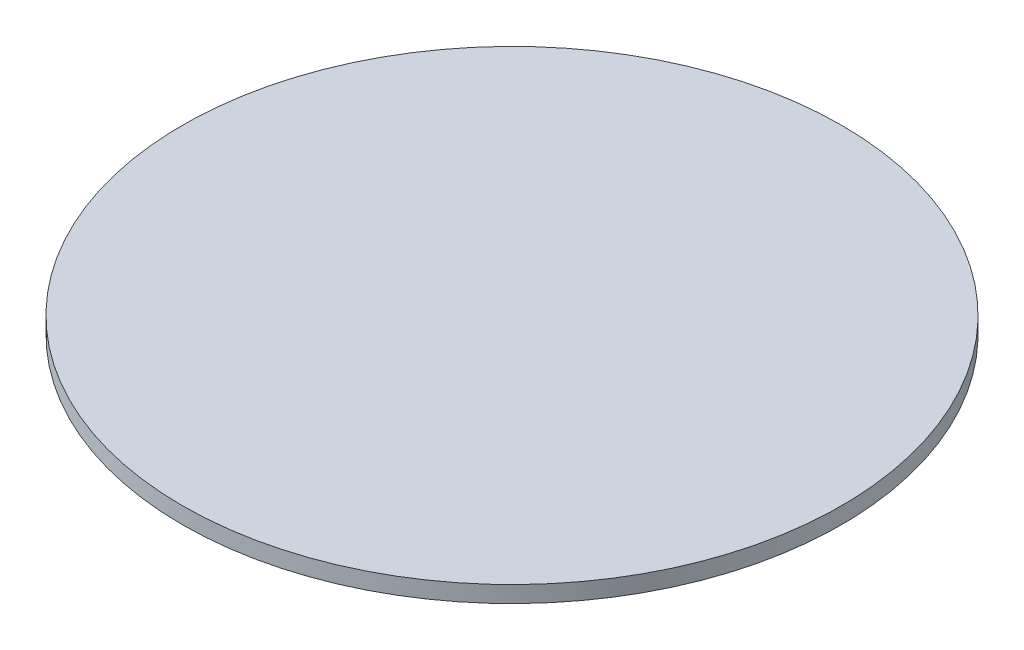
ISO-10303-21;
HEADER;
FILE_DESCRIPTION(('STEP AP214'),'2;1');
FILE_NAME('part.step','',(''),(''),'','','');
FILE_SCHEMA(('AUTOMOTIVE_DESIGN { 1 0 10303 214 1 1 1 1 }'));
ENDSEC;
DATA;
#1=APPLICATION_CONTEXT('core data for automotive mechanical design processes');
#2=APPLICATION_PROTOCOL_DEFINITION('international standard','automotive_design',2000,#1);
#3=PRODUCT_CONTEXT('',#1,'mechanical');
#4=PRODUCT('Part','Part','',(#3));
#5=PRODUCT_RELATED_PRODUCT_CATEGORY('part','',(#4));
#6=PRODUCT_DEFINITION_FORMATION('','',#4);
#7=PRODUCT_DEFINITION_CONTEXT('part definition',#1,'design');
#8=PRODUCT_DEFINITION('design','',#6,#7);
#9=PRODUCT_DEFINITION_SHAPE('','',#8);
#10=(LENGTH_UNIT() NAMED_UNIT(*) SI_UNIT(.MILLI.,.METRE.));
#11=(NAMED_UNIT(*) PLANE_ANGLE_UNIT() SI_UNIT($,.RADIAN.));
#12=(NAMED_UNIT(*) SI_UNIT($,.STERADIAN.) SOLID_ANGLE_UNIT());
#13=UNCERTAINTY_MEASURE_WITH_UNIT(LENGTH_MEASURE(1.E-05),#10,'distance_accuracy_value','');
#14=(GEOMETRIC_REPRESENTATION_CONTEXT(3) GLOBAL_UNCERTAINTY_ASSIGNED_CONTEXT((#13)) GLOBAL_UNIT_ASSIGNED_CONTEXT((#10,
#11,#12)) REPRESENTATION_CONTEXT('',''));
#15=CARTESIAN_POINT('',(0.,0.,0.));
#16=DIRECTION('',(0.,0.,1.));
#17=DIRECTION('',(1.,0.,0.));
#18=AXIS2_PLACEMENT_3D('',#15,#16,#17);
#19=CARTESIAN_POINT('',(0.,0.5,0.));
#20=DIRECTION('',(0.,-1.,0.));
#21=DIRECTION('',(0.,0.,-1.));
#22=AXIS2_PLACEMENT_3D('',#19,#20,#21);
#23=CYLINDRICAL_SURFACE('',#22,10.);
#24=CARTESIAN_POINT('',(0.,0.5,0.));
#25=DIRECTION('',(0.,1.,0.));
#26=DIRECTION('',(0.,0.,1.));
#27=AXIS2_PLACEMENT_3D('',#24,#25,#26);
#28=CIRCLE('',#27,10.);
#29=CARTESIAN_POINT('',(0.,0.5,10.));
#30=VERTEX_POINT('',#29);
#31=EDGE_CURVE('E10',#30,#30,#28,.T.);
#32=ORIENTED_EDGE('',*,*,#31,.F.);
#33=EDGE_LOOP('',(#32));
#34=FACE_BOUND('',#33,.T.);
#35=CARTESIAN_POINT('',(0.,0.,0.));
#36=DIRECTION('',(0.,1.,0.));
#37=DIRECTION('',(0.,0.,1.));
#38=AXIS2_PLACEMENT_3D('',#35,#36,#37);
#39=CIRCLE('',#38,10.);
#40=CARTESIAN_POINT('',(0.,0.,10.));
#41=VERTEX_POINT('',#40);
#42=EDGE_CURVE('E46',#41,#41,#39,.T.);
#43=ORIENTED_EDGE('',*,*,#42,.T.);
#44=EDGE_LOOP('',(#43));
#45=FACE_BOUND('',#44,.T.);
#46=ADVANCED_FACE('F43',(#34,#45),#23,.T.);
#47=CARTESIAN_POINT('',(0.,0.5,0.));
#48=DIRECTION('',(0.,1.,0.));
#49=DIRECTION('',(0.,0.,1.));
#50=AXIS2_PLACEMENT_3D('',#47,#48,#49);
#51=PLANE('',#50);
#52=ORIENTED_EDGE('',*,*,#31,.T.);
#53=EDGE_LOOP('',(#52));
#54=FACE_BOUND('',#53,.T.);
#55=ADVANCED_FACE('F60',(#54),#51,.T.);
#56=CARTESIAN_POINT('',(0.,0.,0.));
#57=DIRECTION('',(0.,1.,0.));
#58=DIRECTION('',(0.,0.,1.));
#59=AXIS2_PLACEMENT_3D('',#56,#57,#58);
#60=PLANE('',#59);
#61=ORIENTED_EDGE('',*,*,#42,.F.);
#62=EDGE_LOOP('',(#61));
#63=FACE_BOUND('',#62,.T.);
#64=ADVANCED_FACE('F58',(#63),#60,.F.);
#65=CLOSED_SHELL('',(#46,#55,#64));
#66=MANIFOLD_SOLID_BREP('B2',#65);
#67=ADVANCED_BREP_SHAPE_REPRESENTATION('',(#18,#66),#14);
#68=SHAPE_DEFINITION_REPRESENTATION(#9,#67);
ENDSEC;
END-ISO-10303-21;
